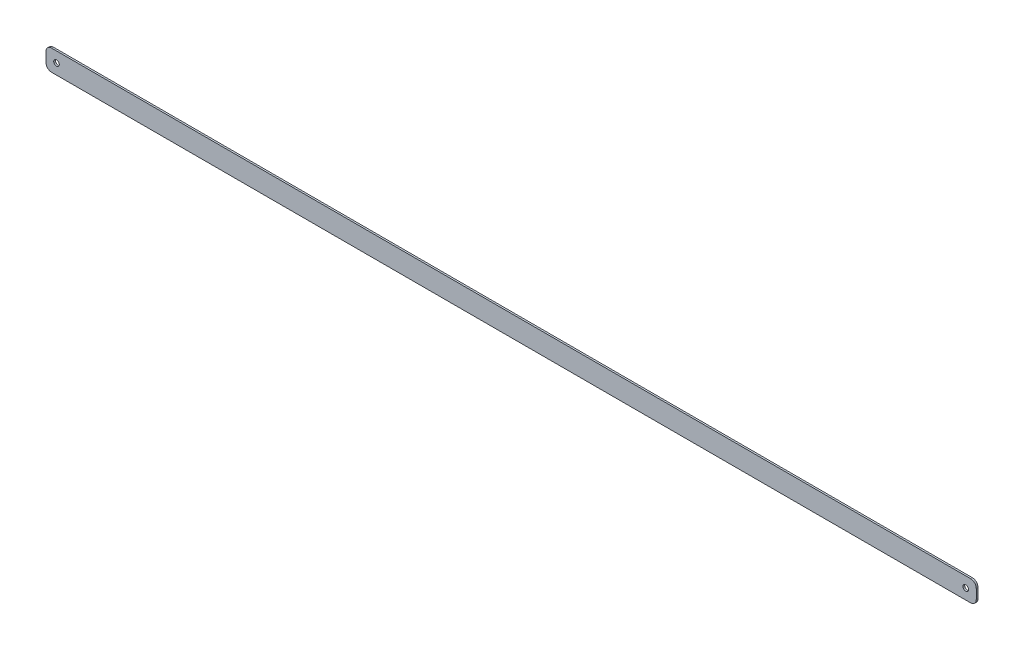
ISO-10303-21;
HEADER;
FILE_DESCRIPTION(('STEP AP214'),'2;1');
FILE_NAME('part.step','',(''),(''),'','','');
FILE_SCHEMA(('AUTOMOTIVE_DESIGN { 1 0 10303 214 1 1 1 1 }'));
ENDSEC;
DATA;
#1=APPLICATION_CONTEXT('core data for automotive mechanical design processes');
#2=APPLICATION_PROTOCOL_DEFINITION('international standard','automotive_design',2000,#1);
#3=PRODUCT_CONTEXT('',#1,'mechanical');
#4=PRODUCT('Part','Part','',(#3));
#5=PRODUCT_RELATED_PRODUCT_CATEGORY('part','',(#4));
#6=PRODUCT_DEFINITION_FORMATION('','',#4);
#7=PRODUCT_DEFINITION_CONTEXT('part definition',#1,'design');
#8=PRODUCT_DEFINITION('design','',#6,#7);
#9=PRODUCT_DEFINITION_SHAPE('','',#8);
#10=(LENGTH_UNIT() NAMED_UNIT(*) SI_UNIT(.MILLI.,.METRE.));
#11=(NAMED_UNIT(*) PLANE_ANGLE_UNIT() SI_UNIT($,.RADIAN.));
#12=(NAMED_UNIT(*) SI_UNIT($,.STERADIAN.) SOLID_ANGLE_UNIT());
#13=UNCERTAINTY_MEASURE_WITH_UNIT(LENGTH_MEASURE(1.E-05),#10,'distance_accuracy_value','');
#14=(GEOMETRIC_REPRESENTATION_CONTEXT(3) GLOBAL_UNCERTAINTY_ASSIGNED_CONTEXT((#13)) GLOBAL_UNIT_ASSIGNED_CONTEXT((#10,
#11,#12)) REPRESENTATION_CONTEXT('',''));
#15=CARTESIAN_POINT('',(0.,0.,0.));
#16=DIRECTION('',(0.,0.,1.));
#17=DIRECTION('',(1.,0.,0.));
#18=AXIS2_PLACEMENT_3D('',#15,#16,#17);
#19=CARTESIAN_POINT('',(-4.445,-4.445,1.5875));
#20=DIRECTION('',(0.,0.,1.));
#21=DIRECTION('',(1.,0.,0.));
#22=AXIS2_PLACEMENT_3D('',#19,#20,#21);
#23=PLANE('',#22);
#24=CARTESIAN_POINT('',(0.,0.,1.5875));
#25=DIRECTION('',(0.,0.,1.));
#26=DIRECTION('',(1.,0.,0.));
#27=AXIS2_PLACEMENT_3D('',#24,#25,#26);
#28=CIRCLE('',#27,2.54);
#29=CARTESIAN_POINT('',(2.54,0.,1.5875));
#30=VERTEX_POINT('',#29);
#31=EDGE_CURVE('E148',#30,#30,#28,.T.);
#32=ORIENTED_EDGE('',*,*,#31,.F.);
#33=EDGE_LOOP('',(#32));
#34=FACE_BOUND('',#33,.T.);
#35=CARTESIAN_POINT('',(-4.445,-4.445,1.5875));
#36=DIRECTION('',(0.,0.,1.));
#37=DIRECTION('',(1.,0.,0.));
#38=AXIS2_PLACEMENT_3D('',#35,#36,#37);
#39=CIRCLE('',#38,5.08);
#40=CARTESIAN_POINT('',(-9.525,-4.44499999999996,1.5875));
#41=VERTEX_POINT('',#40);
#42=CARTESIAN_POINT('',(-4.44499999999996,-9.525,1.5875));
#43=VERTEX_POINT('',#42);
#44=EDGE_CURVE('E164',#41,#43,#39,.T.);
#45=ORIENTED_EDGE('',*,*,#44,.T.);
#46=DIRECTION('',(1.,0.,0.));
#47=VECTOR('',#46,1.);
#48=CARTESIAN_POINT('',(-4.44499999999996,-9.525,1.5875));
#49=LINE('',#48,#47);
#50=CARTESIAN_POINT('',(830.637309004,-9.52499999999999,1.5875));
#51=VERTEX_POINT('',#50);
#52=EDGE_CURVE('E102',#43,#51,#49,.T.);
#53=ORIENTED_EDGE('',*,*,#52,.T.);
#54=CARTESIAN_POINT('',(830.637309004,-4.445,1.5875));
#55=DIRECTION('',(0.,0.,1.));
#56=DIRECTION('',(1.,0.,0.));
#57=AXIS2_PLACEMENT_3D('',#54,#55,#56);
#58=CIRCLE('',#57,5.07999999999999);
#59=CARTESIAN_POINT('',(835.717309004,-4.445,1.5875));
#60=VERTEX_POINT('',#59);
#61=EDGE_CURVE('E184',#51,#60,#58,.T.);
#62=ORIENTED_EDGE('',*,*,#61,.T.);
#63=DIRECTION('',(0.,1.,0.));
#64=VECTOR('',#63,1.);
#65=CARTESIAN_POINT('',(835.717309004,4.445,1.5875));
#66=LINE('',#65,#64);
#67=CARTESIAN_POINT('',(835.717309004,4.445,1.5875));
#68=VERTEX_POINT('',#67);
#69=EDGE_CURVE('E198',#60,#68,#66,.T.);
#70=ORIENTED_EDGE('',*,*,#69,.T.);
#71=CARTESIAN_POINT('',(830.637309004,4.445,1.5875));
#72=DIRECTION('',(0.,0.,1.));
#73=DIRECTION('',(-1.,0.,0.));
#74=AXIS2_PLACEMENT_3D('',#71,#72,#73);
#75=CIRCLE('',#74,5.07999999999999);
#76=CARTESIAN_POINT('',(830.637309004,9.525,1.5875));
#77=VERTEX_POINT('',#76);
#78=EDGE_CURVE('E125',#68,#77,#75,.T.);
#79=ORIENTED_EDGE('',*,*,#78,.T.);
#80=DIRECTION('',(-1.,0.,0.));
#81=VECTOR('',#80,1.);
#82=CARTESIAN_POINT('',(-4.44499999999997,9.525,1.5875));
#83=LINE('',#82,#81);
#84=CARTESIAN_POINT('',(-4.44499999999997,9.525,1.5875));
#85=VERTEX_POINT('',#84);
#86=EDGE_CURVE('E119',#77,#85,#83,.T.);
#87=ORIENTED_EDGE('',*,*,#86,.T.);
#88=CARTESIAN_POINT('',(-4.445,4.445,1.5875));
#89=DIRECTION('',(0.,0.,1.));
#90=DIRECTION('',(1.,0.,0.));
#91=AXIS2_PLACEMENT_3D('',#88,#89,#90);
#92=CIRCLE('',#91,5.08);
#93=CARTESIAN_POINT('',(-9.525,4.44499999999996,1.5875));
#94=VERTEX_POINT('',#93);
#95=EDGE_CURVE('E123',#85,#94,#92,.T.);
#96=ORIENTED_EDGE('',*,*,#95,.T.);
#97=DIRECTION('',(0.,-1.,0.));
#98=VECTOR('',#97,1.);
#99=CARTESIAN_POINT('',(-9.525,4.44499999999996,1.5875));
#100=LINE('',#99,#98);
#101=EDGE_CURVE('E55',#94,#41,#100,.T.);
#102=ORIENTED_EDGE('',*,*,#101,.T.);
#103=EDGE_LOOP('',(#45,#53,#62,#70,#79,#87,#96,#102));
#104=FACE_BOUND('',#103,.T.);
#105=CARTESIAN_POINT('',(826.192309004,0.,1.5875));
#106=DIRECTION('',(0.,0.,1.));
#107=DIRECTION('',(1.,0.,0.));
#108=AXIS2_PLACEMENT_3D('',#105,#106,#107);
#109=CIRCLE('',#108,2.53999999999996);
#110=CARTESIAN_POINT('',(828.732309004,0.,1.5875));
#111=VERTEX_POINT('',#110);
#112=EDGE_CURVE('E209',#111,#111,#109,.T.);
#113=ORIENTED_EDGE('',*,*,#112,.F.);
#114=EDGE_LOOP('',(#113));
#115=FACE_BOUND('',#114,.T.);
#116=ADVANCED_FACE('F38',(#34,#104,#115),#23,.T.);
#117=CARTESIAN_POINT('',(-4.445,-4.445,0.));
#118=DIRECTION('',(0.,0.,1.));
#119=DIRECTION('',(1.,0.,0.));
#120=AXIS2_PLACEMENT_3D('',#117,#118,#119);
#121=PLANE('',#120);
#122=CARTESIAN_POINT('',(-4.445,-4.445,0.));
#123=DIRECTION('',(0.,0.,1.));
#124=DIRECTION('',(1.,0.,0.));
#125=AXIS2_PLACEMENT_3D('',#122,#123,#124);
#126=CIRCLE('',#125,5.08);
#127=CARTESIAN_POINT('',(-9.525,-4.44499999999996,0.));
#128=VERTEX_POINT('',#127);
#129=CARTESIAN_POINT('',(-4.44499999999996,-9.525,0.));
#130=VERTEX_POINT('',#129);
#131=EDGE_CURVE('E144',#128,#130,#126,.T.);
#132=ORIENTED_EDGE('',*,*,#131,.F.);
#133=DIRECTION('',(0.,-1.,0.));
#134=VECTOR('',#133,1.);
#135=CARTESIAN_POINT('',(-9.525,4.44499999999996,0.));
#136=LINE('',#135,#134);
#137=CARTESIAN_POINT('',(-9.525,4.44499999999996,0.));
#138=VERTEX_POINT('',#137);
#139=EDGE_CURVE('E94',#138,#128,#136,.T.);
#140=ORIENTED_EDGE('',*,*,#139,.F.);
#141=CARTESIAN_POINT('',(-4.445,4.445,0.));
#142=DIRECTION('',(0.,0.,1.));
#143=DIRECTION('',(1.,0.,0.));
#144=AXIS2_PLACEMENT_3D('',#141,#142,#143);
#145=CIRCLE('',#144,5.08);
#146=CARTESIAN_POINT('',(-4.44499999999997,9.525,0.));
#147=VERTEX_POINT('',#146);
#148=EDGE_CURVE('E88',#147,#138,#145,.T.);
#149=ORIENTED_EDGE('',*,*,#148,.F.);
#150=DIRECTION('',(-1.,0.,0.));
#151=VECTOR('',#150,1.);
#152=CARTESIAN_POINT('',(-4.44499999999997,9.525,0.));
#153=LINE('',#152,#151);
#154=CARTESIAN_POINT('',(830.637309004,9.525,0.));
#155=VERTEX_POINT('',#154);
#156=EDGE_CURVE('E134',#155,#147,#153,.T.);
#157=ORIENTED_EDGE('',*,*,#156,.F.);
#158=CARTESIAN_POINT('',(830.637309004,4.445,0.));
#159=DIRECTION('',(0.,0.,1.));
#160=DIRECTION('',(-1.,0.,0.));
#161=AXIS2_PLACEMENT_3D('',#158,#159,#160);
#162=CIRCLE('',#161,5.07999999999999);
#163=CARTESIAN_POINT('',(835.717309004,4.445,0.));
#164=VERTEX_POINT('',#163);
#165=EDGE_CURVE('E157',#164,#155,#162,.T.);
#166=ORIENTED_EDGE('',*,*,#165,.F.);
#167=DIRECTION('',(0.,1.,0.));
#168=VECTOR('',#167,1.);
#169=CARTESIAN_POINT('',(835.717309004,4.445,0.));
#170=LINE('',#169,#168);
#171=CARTESIAN_POINT('',(835.717309004,-4.445,0.));
#172=VERTEX_POINT('',#171);
#173=EDGE_CURVE('E154',#172,#164,#170,.T.);
#174=ORIENTED_EDGE('',*,*,#173,.F.);
#175=CARTESIAN_POINT('',(830.637309004,-4.445,0.));
#176=DIRECTION('',(0.,0.,1.));
#177=DIRECTION('',(1.,0.,0.));
#178=AXIS2_PLACEMENT_3D('',#175,#176,#177);
#179=CIRCLE('',#178,5.07999999999999);
#180=CARTESIAN_POINT('',(830.637309004,-9.52499999999999,0.));
#181=VERTEX_POINT('',#180);
#182=EDGE_CURVE('E151',#181,#172,#179,.T.);
#183=ORIENTED_EDGE('',*,*,#182,.F.);
#184=DIRECTION('',(1.,0.,0.));
#185=VECTOR('',#184,1.);
#186=CARTESIAN_POINT('',(-4.44499999999996,-9.525,0.));
#187=LINE('',#186,#185);
#188=EDGE_CURVE('E147',#130,#181,#187,.T.);
#189=ORIENTED_EDGE('',*,*,#188,.F.);
#190=EDGE_LOOP('',(#132,#140,#149,#157,#166,#174,#183,#189));
#191=FACE_BOUND('',#190,.T.);
#192=CARTESIAN_POINT('',(0.,0.,0.));
#193=DIRECTION('',(0.,0.,1.));
#194=DIRECTION('',(1.,0.,0.));
#195=AXIS2_PLACEMENT_3D('',#192,#193,#194);
#196=CIRCLE('',#195,2.54);
#197=CARTESIAN_POINT('',(2.54,0.,0.));
#198=VERTEX_POINT('',#197);
#199=EDGE_CURVE('E206',#198,#198,#196,.T.);
#200=ORIENTED_EDGE('',*,*,#199,.T.);
#201=EDGE_LOOP('',(#200));
#202=FACE_BOUND('',#201,.T.);
#203=CARTESIAN_POINT('',(826.192309004,0.,0.));
#204=DIRECTION('',(0.,0.,1.));
#205=DIRECTION('',(1.,0.,0.));
#206=AXIS2_PLACEMENT_3D('',#203,#204,#205);
#207=CIRCLE('',#206,2.53999999999996);
#208=CARTESIAN_POINT('',(828.732309004,0.,0.));
#209=VERTEX_POINT('',#208);
#210=EDGE_CURVE('E212',#209,#209,#207,.T.);
#211=ORIENTED_EDGE('',*,*,#210,.T.);
#212=EDGE_LOOP('',(#211));
#213=FACE_BOUND('',#212,.T.);
#214=ADVANCED_FACE('F188',(#191,#202,#213),#121,.F.);
#215=CARTESIAN_POINT('',(-4.445,-4.445,1.5875));
#216=DIRECTION('',(0.,0.,-1.));
#217=DIRECTION('',(-1.,0.,0.));
#218=AXIS2_PLACEMENT_3D('',#215,#216,#217);
#219=CYLINDRICAL_SURFACE('',#218,5.08);
#220=ORIENTED_EDGE('',*,*,#131,.T.);
#221=DIRECTION('',(0.,0.,-1.));
#222=VECTOR('',#221,1.);
#223=CARTESIAN_POINT('',(-4.44499999999996,-9.525,1.5875));
#224=LINE('',#223,#222);
#225=EDGE_CURVE('E11',#43,#130,#224,.T.);
#226=ORIENTED_EDGE('',*,*,#225,.F.);
#227=ORIENTED_EDGE('',*,*,#44,.F.);
#228=DIRECTION('',(0.,0.,-1.));
#229=VECTOR('',#228,1.);
#230=CARTESIAN_POINT('',(-9.525,-4.44499999999996,1.5875));
#231=LINE('',#230,#229);
#232=EDGE_CURVE('E140',#41,#128,#231,.T.);
#233=ORIENTED_EDGE('',*,*,#232,.T.);
#234=EDGE_LOOP('',(#220,#226,#227,#233));
#235=FACE_BOUND('',#234,.T.);
#236=ADVANCED_FACE('F40',(#235),#219,.T.);
#237=CARTESIAN_POINT('',(-4.44499999999996,-9.525,1.5875));
#238=DIRECTION('',(0.,1.,0.));
#239=DIRECTION('',(0.,0.,1.));
#240=AXIS2_PLACEMENT_3D('',#237,#238,#239);
#241=PLANE('',#240);
#242=ORIENTED_EDGE('',*,*,#188,.T.);
#243=DIRECTION('',(0.,0.,-1.));
#244=VECTOR('',#243,1.);
#245=CARTESIAN_POINT('',(830.637309004,-9.52499999999999,1.5875));
#246=LINE('',#245,#244);
#247=EDGE_CURVE('E47',#51,#181,#246,.T.);
#248=ORIENTED_EDGE('',*,*,#247,.F.);
#249=ORIENTED_EDGE('',*,*,#52,.F.);
#250=ORIENTED_EDGE('',*,*,#225,.T.);
#251=EDGE_LOOP('',(#242,#248,#249,#250));
#252=FACE_BOUND('',#251,.T.);
#253=ADVANCED_FACE('F246',(#252),#241,.F.);
#254=CARTESIAN_POINT('',(830.637309004,-4.445,1.5875));
#255=DIRECTION('',(0.,0.,-1.));
#256=DIRECTION('',(-1.,0.,0.));
#257=AXIS2_PLACEMENT_3D('',#254,#255,#256);
#258=CYLINDRICAL_SURFACE('',#257,5.07999999999999);
#259=ORIENTED_EDGE('',*,*,#182,.T.);
#260=DIRECTION('',(0.,0.,-1.));
#261=VECTOR('',#260,1.);
#262=CARTESIAN_POINT('',(835.717309004,-4.445,1.5875));
#263=LINE('',#262,#261);
#264=EDGE_CURVE('E173',#60,#172,#263,.T.);
#265=ORIENTED_EDGE('',*,*,#264,.F.);
#266=ORIENTED_EDGE('',*,*,#61,.F.);
#267=ORIENTED_EDGE('',*,*,#247,.T.);
#268=EDGE_LOOP('',(#259,#265,#266,#267));
#269=FACE_BOUND('',#268,.T.);
#270=ADVANCED_FACE('F182',(#269),#258,.T.);
#271=CARTESIAN_POINT('',(835.717309004,4.445,1.5875));
#272=DIRECTION('',(-1.,0.,0.));
#273=DIRECTION('',(0.,0.,1.));
#274=AXIS2_PLACEMENT_3D('',#271,#272,#273);
#275=PLANE('',#274);
#276=ORIENTED_EDGE('',*,*,#173,.T.);
#277=DIRECTION('',(0.,0.,-1.));
#278=VECTOR('',#277,1.);
#279=CARTESIAN_POINT('',(835.717309004,4.445,1.5875));
#280=LINE('',#279,#278);
#281=EDGE_CURVE('E169',#68,#164,#280,.T.);
#282=ORIENTED_EDGE('',*,*,#281,.F.);
#283=ORIENTED_EDGE('',*,*,#69,.F.);
#284=ORIENTED_EDGE('',*,*,#264,.T.);
#285=EDGE_LOOP('',(#276,#282,#283,#284));
#286=FACE_BOUND('',#285,.T.);
#287=ADVANCED_FACE('F193',(#286),#275,.F.);
#288=CARTESIAN_POINT('',(830.637309004,4.445,1.5875));
#289=DIRECTION('',(0.,0.,-1.));
#290=DIRECTION('',(-1.,0.,0.));
#291=AXIS2_PLACEMENT_3D('',#288,#289,#290);
#292=CYLINDRICAL_SURFACE('',#291,5.07999999999999);
#293=ORIENTED_EDGE('',*,*,#165,.T.);
#294=DIRECTION('',(0.,0.,-1.));
#295=VECTOR('',#294,1.);
#296=CARTESIAN_POINT('',(830.637309004,9.525,1.5875));
#297=LINE('',#296,#295);
#298=EDGE_CURVE('E135',#77,#155,#297,.T.);
#299=ORIENTED_EDGE('',*,*,#298,.F.);
#300=ORIENTED_EDGE('',*,*,#78,.F.);
#301=ORIENTED_EDGE('',*,*,#281,.T.);
#302=EDGE_LOOP('',(#293,#299,#300,#301));
#303=FACE_BOUND('',#302,.T.);
#304=ADVANCED_FACE('F196',(#303),#292,.T.);
#305=CARTESIAN_POINT('',(-4.44499999999997,9.525,1.5875));
#306=DIRECTION('',(0.,-1.,0.));
#307=DIRECTION('',(0.,0.,-1.));
#308=AXIS2_PLACEMENT_3D('',#305,#306,#307);
#309=PLANE('',#308);
#310=ORIENTED_EDGE('',*,*,#156,.T.);
#311=DIRECTION('',(0.,0.,-1.));
#312=VECTOR('',#311,1.);
#313=CARTESIAN_POINT('',(-4.44499999999997,9.525,1.5875));
#314=LINE('',#313,#312);
#315=EDGE_CURVE('E131',#85,#147,#314,.T.);
#316=ORIENTED_EDGE('',*,*,#315,.F.);
#317=ORIENTED_EDGE('',*,*,#86,.F.);
#318=ORIENTED_EDGE('',*,*,#298,.T.);
#319=EDGE_LOOP('',(#310,#316,#317,#318));
#320=FACE_BOUND('',#319,.T.);
#321=ADVANCED_FACE('F132',(#320),#309,.F.);
#322=CARTESIAN_POINT('',(-4.445,4.445,1.5875));
#323=DIRECTION('',(0.,0.,-1.));
#324=DIRECTION('',(-1.,0.,0.));
#325=AXIS2_PLACEMENT_3D('',#322,#323,#324);
#326=CYLINDRICAL_SURFACE('',#325,5.08);
#327=ORIENTED_EDGE('',*,*,#148,.T.);
#328=DIRECTION('',(0.,0.,-1.));
#329=VECTOR('',#328,1.);
#330=CARTESIAN_POINT('',(-9.525,4.44499999999996,1.5875));
#331=LINE('',#330,#329);
#332=EDGE_CURVE('E136',#94,#138,#331,.T.);
#333=ORIENTED_EDGE('',*,*,#332,.F.);
#334=ORIENTED_EDGE('',*,*,#95,.F.);
#335=ORIENTED_EDGE('',*,*,#315,.T.);
#336=EDGE_LOOP('',(#327,#333,#334,#335));
#337=FACE_BOUND('',#336,.T.);
#338=ADVANCED_FACE('F138',(#337),#326,.T.);
#339=CARTESIAN_POINT('',(-9.525,4.44499999999996,1.5875));
#340=DIRECTION('',(1.,0.,0.));
#341=DIRECTION('',(0.,1.,0.));
#342=AXIS2_PLACEMENT_3D('',#339,#340,#341);
#343=PLANE('',#342);
#344=ORIENTED_EDGE('',*,*,#139,.T.);
#345=ORIENTED_EDGE('',*,*,#232,.F.);
#346=ORIENTED_EDGE('',*,*,#101,.F.);
#347=ORIENTED_EDGE('',*,*,#332,.T.);
#348=EDGE_LOOP('',(#344,#345,#346,#347));
#349=FACE_BOUND('',#348,.T.);
#350=ADVANCED_FACE('F234',(#349),#343,.F.);
#351=CARTESIAN_POINT('',(0.,0.,1.5875));
#352=DIRECTION('',(0.,0.,-1.));
#353=DIRECTION('',(-1.,0.,0.));
#354=AXIS2_PLACEMENT_3D('',#351,#352,#353);
#355=CYLINDRICAL_SURFACE('',#354,2.54);
#356=ORIENTED_EDGE('',*,*,#31,.T.);
#357=EDGE_LOOP('',(#356));
#358=FACE_BOUND('',#357,.T.);
#359=ORIENTED_EDGE('',*,*,#199,.F.);
#360=EDGE_LOOP('',(#359));
#361=FACE_BOUND('',#360,.T.);
#362=ADVANCED_FACE('F231',(#358,#361),#355,.F.);
#363=CARTESIAN_POINT('',(826.192309004,0.,1.5875));
#364=DIRECTION('',(0.,0.,-1.));
#365=DIRECTION('',(-1.,0.,0.));
#366=AXIS2_PLACEMENT_3D('',#363,#364,#365);
#367=CYLINDRICAL_SURFACE('',#366,2.53999999999996);
#368=ORIENTED_EDGE('',*,*,#112,.T.);
#369=EDGE_LOOP('',(#368));
#370=FACE_BOUND('',#369,.T.);
#371=ORIENTED_EDGE('',*,*,#210,.F.);
#372=EDGE_LOOP('',(#371));
#373=FACE_BOUND('',#372,.T.);
#374=ADVANCED_FACE('F220',(#370,#373),#367,.F.);
#375=CLOSED_SHELL('',(#116,#214,#236,#253,#270,#287,#304,#321,#338,#350,#362,#374));
#376=MANIFOLD_SOLID_BREP('B2',#375);
#377=ADVANCED_BREP_SHAPE_REPRESENTATION('',(#18,#376),#14);
#378=SHAPE_DEFINITION_REPRESENTATION(#9,#377);
ENDSEC;
END-ISO-10303-21;
